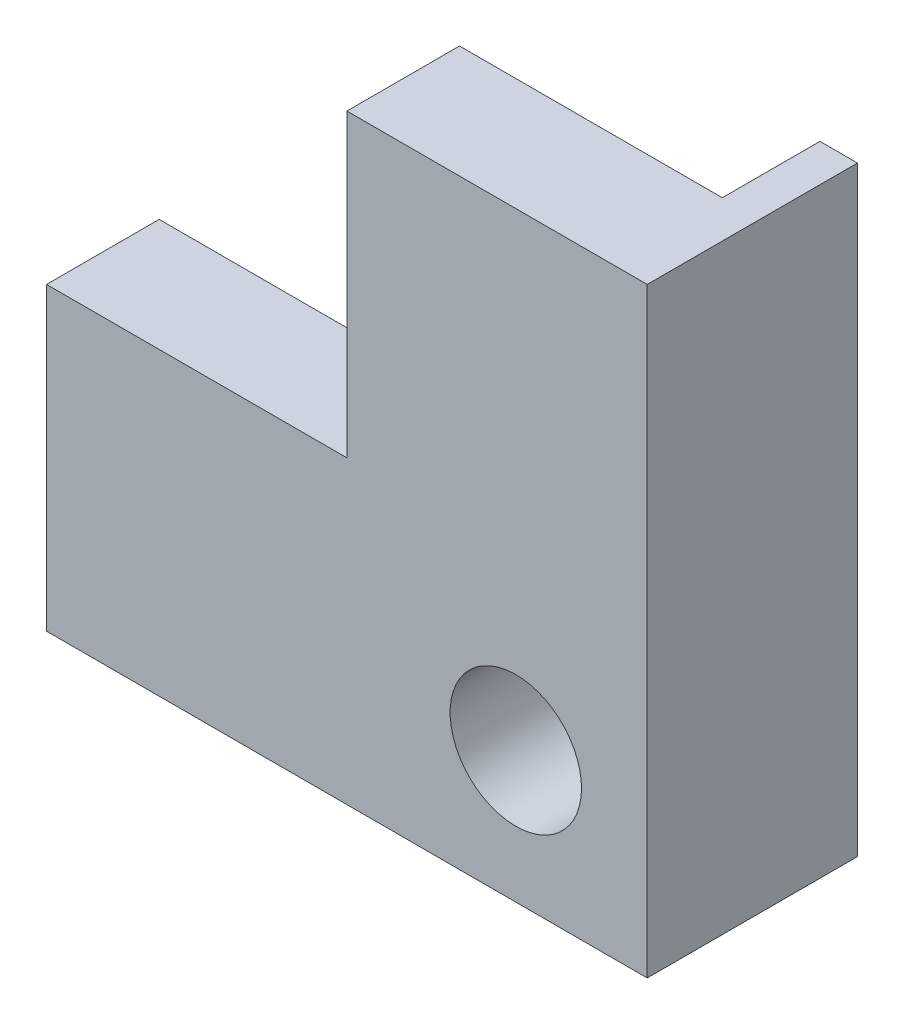
ISO-10303-21;
HEADER;
FILE_DESCRIPTION(('STEP AP214'),'2;1');
FILE_NAME('part.step','',(''),(''),'','','');
FILE_SCHEMA(('AUTOMOTIVE_DESIGN { 1 0 10303 214 1 1 1 1 }'));
ENDSEC;
DATA;
#1=APPLICATION_CONTEXT('core data for automotive mechanical design processes');
#2=APPLICATION_PROTOCOL_DEFINITION('international standard','automotive_design',2000,#1);
#3=PRODUCT_CONTEXT('',#1,'mechanical');
#4=PRODUCT('Part','Part','',(#3));
#5=PRODUCT_RELATED_PRODUCT_CATEGORY('part','',(#4));
#6=PRODUCT_DEFINITION_FORMATION('','',#4);
#7=PRODUCT_DEFINITION_CONTEXT('part definition',#1,'design');
#8=PRODUCT_DEFINITION('design','',#6,#7);
#9=PRODUCT_DEFINITION_SHAPE('','',#8);
#10=(LENGTH_UNIT() NAMED_UNIT(*) SI_UNIT(.MILLI.,.METRE.));
#11=(NAMED_UNIT(*) PLANE_ANGLE_UNIT() SI_UNIT($,.RADIAN.));
#12=(NAMED_UNIT(*) SI_UNIT($,.STERADIAN.) SOLID_ANGLE_UNIT());
#13=UNCERTAINTY_MEASURE_WITH_UNIT(LENGTH_MEASURE(1.E-05),#10,'distance_accuracy_value','');
#14=(GEOMETRIC_REPRESENTATION_CONTEXT(3) GLOBAL_UNCERTAINTY_ASSIGNED_CONTEXT((#13)) GLOBAL_UNIT_ASSIGNED_CONTEXT((#10,
#11,#12)) REPRESENTATION_CONTEXT('',''));
#15=CARTESIAN_POINT('',(0.,0.,0.));
#16=DIRECTION('',(0.,0.,1.));
#17=DIRECTION('',(1.,0.,0.));
#18=AXIS2_PLACEMENT_3D('',#15,#16,#17);
#19=CARTESIAN_POINT('',(0.,0.,3.));
#20=DIRECTION('',(0.,0.,-1.));
#21=DIRECTION('',(-1.,0.,0.));
#22=AXIS2_PLACEMENT_3D('',#19,#20,#21);
#23=PLANE('',#22);
#24=DIRECTION('',(0.,1.,0.));
#25=VECTOR('',#24,1.);
#26=CARTESIAN_POINT('',(105.864902494354,-136.367060458206,3.));
#27=LINE('',#26,#25);
#28=CARTESIAN_POINT('',(105.864902494354,-136.367060458206,3.));
#29=VERTEX_POINT('',#28);
#30=CARTESIAN_POINT('',(105.864902494354,-120.367060458206,3.));
#31=VERTEX_POINT('',#30);
#32=EDGE_CURVE('E161',#29,#31,#27,.T.);
#33=ORIENTED_EDGE('',*,*,#32,.T.);
#34=DIRECTION('',(-1.,0.,0.));
#35=VECTOR('',#34,1.);
#36=CARTESIAN_POINT('',(97.8649024943537,-120.367060458206,3.));
#37=LINE('',#36,#35);
#38=CARTESIAN_POINT('',(97.8649024943537,-120.367060458206,3.));
#39=VERTEX_POINT('',#38);
#40=EDGE_CURVE('E196',#31,#39,#37,.T.);
#41=ORIENTED_EDGE('',*,*,#40,.T.);
#42=DIRECTION('',(0.,-1.,0.));
#43=VECTOR('',#42,1.);
#44=CARTESIAN_POINT('',(97.8649024943537,-128.367060458206,3.));
#45=LINE('',#44,#43);
#46=CARTESIAN_POINT('',(97.8649024943537,-128.367060458206,3.));
#47=VERTEX_POINT('',#46);
#48=EDGE_CURVE('E198',#39,#47,#45,.T.);
#49=ORIENTED_EDGE('',*,*,#48,.T.);
#50=DIRECTION('',(-1.,0.,0.));
#51=VECTOR('',#50,1.);
#52=CARTESIAN_POINT('',(89.8649024943537,-128.367060458206,3.));
#53=LINE('',#52,#51);
#54=CARTESIAN_POINT('',(89.8649024943537,-128.367060458206,3.));
#55=VERTEX_POINT('',#54);
#56=EDGE_CURVE('E201',#47,#55,#53,.T.);
#57=ORIENTED_EDGE('',*,*,#56,.T.);
#58=DIRECTION('',(0.,-1.,0.));
#59=VECTOR('',#58,1.);
#60=CARTESIAN_POINT('',(89.8649024943537,-135.367060458206,3.));
#61=LINE('',#60,#59);
#62=CARTESIAN_POINT('',(89.8649024943537,-136.367060458206,3.));
#63=VERTEX_POINT('',#62);
#64=EDGE_CURVE('E203',#55,#63,#61,.T.);
#65=ORIENTED_EDGE('',*,*,#64,.T.);
#66=DIRECTION('',(1.,0.,0.));
#67=VECTOR('',#66,1.);
#68=CARTESIAN_POINT('',(89.8649024943537,-136.367060458206,3.));
#69=LINE('',#68,#67);
#70=EDGE_CURVE('E158',#63,#29,#69,.T.);
#71=ORIENTED_EDGE('',*,*,#70,.T.);
#72=EDGE_LOOP('',(#33,#41,#49,#57,#65,#71));
#73=FACE_BOUND('',#72,.T.);
#74=CARTESIAN_POINT('',(102.364902494354,-132.867060458206,3.));
#75=DIRECTION('',(0.,0.,1.));
#76=DIRECTION('',(1.,0.,0.));
#77=AXIS2_PLACEMENT_3D('',#74,#75,#76);
#78=CIRCLE('',#77,1.75);
#79=CARTESIAN_POINT('',(104.114902494354,-132.867060458206,3.));
#80=VERTEX_POINT('',#79);
#81=EDGE_CURVE('E190',#80,#80,#78,.T.);
#82=ORIENTED_EDGE('',*,*,#81,.F.);
#83=EDGE_LOOP('',(#82));
#84=FACE_BOUND('',#83,.T.);
#85=ADVANCED_FACE('F33',(#73,#84),#23,.F.);
#86=CARTESIAN_POINT('',(0.,0.,0.));
#87=DIRECTION('',(0.,0.,-1.));
#88=DIRECTION('',(-1.,0.,0.));
#89=AXIS2_PLACEMENT_3D('',#86,#87,#88);
#90=PLANE('',#89);
#91=DIRECTION('',(0.,1.,0.));
#92=VECTOR('',#91,1.);
#93=CARTESIAN_POINT('',(104.864902494354,-120.367060458206,0.));
#94=LINE('',#93,#92);
#95=CARTESIAN_POINT('',(104.864902494354,-135.367060458206,0.));
#96=VERTEX_POINT('',#95);
#97=CARTESIAN_POINT('',(104.864902494354,-120.367060458206,0.));
#98=VERTEX_POINT('',#97);
#99=EDGE_CURVE('E193',#96,#98,#94,.T.);
#100=ORIENTED_EDGE('',*,*,#99,.F.);
#101=DIRECTION('',(1.,0.,0.));
#102=VECTOR('',#101,1.);
#103=CARTESIAN_POINT('',(104.864902494354,-135.367060458206,0.));
#104=LINE('',#103,#102);
#105=CARTESIAN_POINT('',(89.8649024943537,-135.367060458206,0.));
#106=VERTEX_POINT('',#105);
#107=EDGE_CURVE('E199',#106,#96,#104,.T.);
#108=ORIENTED_EDGE('',*,*,#107,.F.);
#109=DIRECTION('',(0.,-1.,0.));
#110=VECTOR('',#109,1.);
#111=CARTESIAN_POINT('',(89.8649024943537,-135.367060458206,0.));
#112=LINE('',#111,#110);
#113=CARTESIAN_POINT('',(89.8649024943537,-128.367060458206,0.));
#114=VERTEX_POINT('',#113);
#115=EDGE_CURVE('E213',#114,#106,#112,.T.);
#116=ORIENTED_EDGE('',*,*,#115,.F.);
#117=DIRECTION('',(-1.,0.,0.));
#118=VECTOR('',#117,1.);
#119=CARTESIAN_POINT('',(89.8649024943537,-128.367060458206,0.));
#120=LINE('',#119,#118);
#121=CARTESIAN_POINT('',(97.8649024943537,-128.367060458206,0.));
#122=VERTEX_POINT('',#121);
#123=EDGE_CURVE('E211',#122,#114,#120,.T.);
#124=ORIENTED_EDGE('',*,*,#123,.F.);
#125=DIRECTION('',(0.,-1.,0.));
#126=VECTOR('',#125,1.);
#127=CARTESIAN_POINT('',(97.8649024943537,-128.367060458206,0.));
#128=LINE('',#127,#126);
#129=CARTESIAN_POINT('',(97.8649024943537,-120.367060458206,0.));
#130=VERTEX_POINT('',#129);
#131=EDGE_CURVE('E209',#130,#122,#128,.T.);
#132=ORIENTED_EDGE('',*,*,#131,.F.);
#133=DIRECTION('',(-1.,0.,0.));
#134=VECTOR('',#133,1.);
#135=CARTESIAN_POINT('',(97.8649024943537,-120.367060458206,0.));
#136=LINE('',#135,#134);
#137=EDGE_CURVE('E207',#98,#130,#136,.T.);
#138=ORIENTED_EDGE('',*,*,#137,.F.);
#139=EDGE_LOOP('',(#100,#108,#116,#124,#132,#138));
#140=FACE_BOUND('',#139,.T.);
#141=CARTESIAN_POINT('',(102.364902494354,-132.867060458206,0.));
#142=DIRECTION('',(0.,0.,1.));
#143=DIRECTION('',(1.,0.,0.));
#144=AXIS2_PLACEMENT_3D('',#141,#142,#143);
#145=CIRCLE('',#144,1.75);
#146=CARTESIAN_POINT('',(104.114902494354,-132.867060458206,0.));
#147=VERTEX_POINT('',#146);
#148=EDGE_CURVE('E177',#147,#147,#145,.T.);
#149=ORIENTED_EDGE('',*,*,#148,.T.);
#150=EDGE_LOOP('',(#149));
#151=FACE_BOUND('',#150,.T.);
#152=ADVANCED_FACE('F231',(#140,#151),#90,.T.);
#153=CARTESIAN_POINT('',(97.8649024943537,-120.367060458206,3.));
#154=DIRECTION('',(0.,-1.,0.));
#155=DIRECTION('',(0.,0.,-1.));
#156=AXIS2_PLACEMENT_3D('',#153,#154,#155);
#157=PLANE('',#156);
#158=ORIENTED_EDGE('',*,*,#137,.T.);
#159=DIRECTION('',(0.,0.,-1.));
#160=VECTOR('',#159,1.);
#161=CARTESIAN_POINT('',(97.8649024943537,-120.367060458206,3.));
#162=LINE('',#161,#160);
#163=EDGE_CURVE('E11',#39,#130,#162,.T.);
#164=ORIENTED_EDGE('',*,*,#163,.F.);
#165=ORIENTED_EDGE('',*,*,#40,.F.);
#166=DIRECTION('',(0.,0.,1.));
#167=VECTOR('',#166,1.);
#168=CARTESIAN_POINT('',(105.864902494354,-120.367060458206,-2.6));
#169=LINE('',#168,#167);
#170=CARTESIAN_POINT('',(105.864902494354,-120.367060458206,-2.6));
#171=VERTEX_POINT('',#170);
#172=EDGE_CURVE('E179',#171,#31,#169,.T.);
#173=ORIENTED_EDGE('',*,*,#172,.F.);
#174=DIRECTION('',(-1.,0.,0.));
#175=VECTOR('',#174,1.);
#176=CARTESIAN_POINT('',(105.864902494354,-120.367060458206,-2.6));
#177=LINE('',#176,#175);
#178=CARTESIAN_POINT('',(104.864902494354,-120.367060458206,-2.6));
#179=VERTEX_POINT('',#178);
#180=EDGE_CURVE('E132',#171,#179,#177,.T.);
#181=ORIENTED_EDGE('',*,*,#180,.T.);
#182=DIRECTION('',(0.,0.,1.));
#183=VECTOR('',#182,1.);
#184=CARTESIAN_POINT('',(104.864902494354,-120.367060458206,-2.6));
#185=LINE('',#184,#183);
#186=CARTESIAN_POINT('',(104.864902494354,-120.367060458206,-1.6));
#187=VERTEX_POINT('',#186);
#188=EDGE_CURVE('E143',#179,#187,#185,.T.);
#189=ORIENTED_EDGE('',*,*,#188,.T.);
#190=EDGE_CURVE('E53',#187,#98,#185,.T.);
#191=ORIENTED_EDGE('',*,*,#190,.T.);
#192=EDGE_LOOP('',(#158,#164,#165,#173,#181,#189,#191));
#193=FACE_BOUND('',#192,.T.);
#194=ADVANCED_FACE('F35',(#193),#157,.F.);
#195=CARTESIAN_POINT('',(97.8649024943537,-128.367060458206,3.));
#196=DIRECTION('',(1.,0.,0.));
#197=DIRECTION('',(0.,1.,0.));
#198=AXIS2_PLACEMENT_3D('',#195,#196,#197);
#199=PLANE('',#198);
#200=ORIENTED_EDGE('',*,*,#131,.T.);
#201=DIRECTION('',(0.,0.,-1.));
#202=VECTOR('',#201,1.);
#203=CARTESIAN_POINT('',(97.8649024943537,-128.367060458206,3.));
#204=LINE('',#203,#202);
#205=EDGE_CURVE('E41',#47,#122,#204,.T.);
#206=ORIENTED_EDGE('',*,*,#205,.F.);
#207=ORIENTED_EDGE('',*,*,#48,.F.);
#208=ORIENTED_EDGE('',*,*,#163,.T.);
#209=EDGE_LOOP('',(#200,#206,#207,#208));
#210=FACE_BOUND('',#209,.T.);
#211=ADVANCED_FACE('F244',(#210),#199,.F.);
#212=CARTESIAN_POINT('',(89.8649024943537,-128.367060458206,3.));
#213=DIRECTION('',(0.,-1.,0.));
#214=DIRECTION('',(0.,0.,-1.));
#215=AXIS2_PLACEMENT_3D('',#212,#213,#214);
#216=PLANE('',#215);
#217=ORIENTED_EDGE('',*,*,#123,.T.);
#218=DIRECTION('',(0.,0.,-1.));
#219=VECTOR('',#218,1.);
#220=CARTESIAN_POINT('',(89.8649024943537,-128.367060458206,3.));
#221=LINE('',#220,#219);
#222=EDGE_CURVE('E205',#55,#114,#221,.T.);
#223=ORIENTED_EDGE('',*,*,#222,.F.);
#224=ORIENTED_EDGE('',*,*,#56,.F.);
#225=ORIENTED_EDGE('',*,*,#205,.T.);
#226=EDGE_LOOP('',(#217,#223,#224,#225));
#227=FACE_BOUND('',#226,.T.);
#228=ADVANCED_FACE('F223',(#227),#216,.F.);
#229=CARTESIAN_POINT('',(89.8649024943537,-135.367060458206,3.));
#230=DIRECTION('',(1.,0.,0.));
#231=DIRECTION('',(0.,0.,-1.));
#232=AXIS2_PLACEMENT_3D('',#229,#230,#231);
#233=PLANE('',#232);
#234=ORIENTED_EDGE('',*,*,#115,.T.);
#235=DIRECTION('',(0.,0.,1.));
#236=VECTOR('',#235,1.);
#237=CARTESIAN_POINT('',(89.8649024943537,-135.367060458206,-2.6));
#238=LINE('',#237,#236);
#239=CARTESIAN_POINT('',(89.8649024943537,-135.367060458206,-1.6));
#240=VERTEX_POINT('',#239);
#241=EDGE_CURVE('E131',#240,#106,#238,.T.);
#242=ORIENTED_EDGE('',*,*,#241,.F.);
#243=CARTESIAN_POINT('',(89.8649024943537,-135.367060458206,-2.6));
#244=VERTEX_POINT('',#243);
#245=EDGE_CURVE('E187',#244,#240,#238,.T.);
#246=ORIENTED_EDGE('',*,*,#245,.F.);
#247=DIRECTION('',(0.,-1.,0.));
#248=VECTOR('',#247,1.);
#249=CARTESIAN_POINT('',(89.8649024943537,-135.367060458206,-2.6));
#250=LINE('',#249,#248);
#251=CARTESIAN_POINT('',(89.8649024943537,-136.367060458206,-2.6));
#252=VERTEX_POINT('',#251);
#253=EDGE_CURVE('E160',#244,#252,#250,.T.);
#254=ORIENTED_EDGE('',*,*,#253,.T.);
#255=DIRECTION('',(0.,0.,1.));
#256=VECTOR('',#255,1.);
#257=CARTESIAN_POINT('',(89.8649024943537,-136.367060458206,-2.6));
#258=LINE('',#257,#256);
#259=EDGE_CURVE('E184',#252,#63,#258,.T.);
#260=ORIENTED_EDGE('',*,*,#259,.T.);
#261=ORIENTED_EDGE('',*,*,#64,.F.);
#262=ORIENTED_EDGE('',*,*,#222,.T.);
#263=EDGE_LOOP('',(#234,#242,#246,#254,#260,#261,#262));
#264=FACE_BOUND('',#263,.T.);
#265=ADVANCED_FACE('F237',(#264),#233,.F.);
#266=CARTESIAN_POINT('',(102.364902494354,-132.867060458206,3.));
#267=DIRECTION('',(0.,0.,-1.));
#268=DIRECTION('',(-1.,0.,0.));
#269=AXIS2_PLACEMENT_3D('',#266,#267,#268);
#270=CYLINDRICAL_SURFACE('',#269,1.75);
#271=ORIENTED_EDGE('',*,*,#81,.T.);
#272=EDGE_LOOP('',(#271));
#273=FACE_BOUND('',#272,.T.);
#274=ORIENTED_EDGE('',*,*,#148,.F.);
#275=EDGE_LOOP('',(#274));
#276=FACE_BOUND('',#275,.T.);
#277=ADVANCED_FACE('F277',(#273,#276),#270,.F.);
#278=CARTESIAN_POINT('',(104.864902494354,-135.367060458206,-2.6));
#279=DIRECTION('',(0.,1.,0.));
#280=DIRECTION('',(0.,0.,1.));
#281=AXIS2_PLACEMENT_3D('',#278,#279,#280);
#282=PLANE('',#281);
#283=DIRECTION('',(0.,0.,-1.));
#284=VECTOR('',#283,1.);
#285=CARTESIAN_POINT('',(97.3649024943537,-135.367060458206,-1.6));
#286=LINE('',#285,#284);
#287=CARTESIAN_POINT('',(97.3649024943537,-135.367060458206,-1.6));
#288=VERTEX_POINT('',#287);
#289=CARTESIAN_POINT('',(97.3649024943537,-135.367060458206,-2.6));
#290=VERTEX_POINT('',#289);
#291=EDGE_CURVE('E154',#288,#290,#286,.T.);
#292=ORIENTED_EDGE('',*,*,#291,.F.);
#293=DIRECTION('',(-1.,0.,0.));
#294=VECTOR('',#293,1.);
#295=CARTESIAN_POINT('',(89.8649024943537,-135.367060458206,-1.6));
#296=LINE('',#295,#294);
#297=EDGE_CURVE('E152',#288,#240,#296,.T.);
#298=ORIENTED_EDGE('',*,*,#297,.T.);
#299=ORIENTED_EDGE('',*,*,#241,.T.);
#300=ORIENTED_EDGE('',*,*,#107,.T.);
#301=DIRECTION('',(0.,0.,1.));
#302=VECTOR('',#301,1.);
#303=CARTESIAN_POINT('',(104.864902494354,-135.367060458206,-2.6));
#304=LINE('',#303,#302);
#305=CARTESIAN_POINT('',(104.864902494354,-135.367060458206,-2.6));
#306=VERTEX_POINT('',#305);
#307=EDGE_CURVE('E175',#306,#96,#304,.T.);
#308=ORIENTED_EDGE('',*,*,#307,.F.);
#309=DIRECTION('',(-1.,0.,0.));
#310=VECTOR('',#309,1.);
#311=CARTESIAN_POINT('',(104.864902494354,-135.367060458206,-2.6));
#312=LINE('',#311,#310);
#313=EDGE_CURVE('E128',#306,#290,#312,.T.);
#314=ORIENTED_EDGE('',*,*,#313,.T.);
#315=EDGE_LOOP('',(#292,#298,#299,#300,#308,#314));
#316=FACE_BOUND('',#315,.T.);
#317=ADVANCED_FACE('F247',(#316),#282,.T.);
#318=CARTESIAN_POINT('',(104.864902494354,-120.367060458206,-2.6));
#319=DIRECTION('',(-1.,0.,0.));
#320=DIRECTION('',(0.,-1.,0.));
#321=AXIS2_PLACEMENT_3D('',#318,#319,#320);
#322=PLANE('',#321);
#323=DIRECTION('',(0.,0.,-1.));
#324=VECTOR('',#323,1.);
#325=CARTESIAN_POINT('',(104.864902494354,-127.867060458206,-1.6));
#326=LINE('',#325,#324);
#327=CARTESIAN_POINT('',(104.864902494354,-127.867060458206,-1.6));
#328=VERTEX_POINT('',#327);
#329=CARTESIAN_POINT('',(104.864902494354,-127.867060458206,-2.6));
#330=VERTEX_POINT('',#329);
#331=EDGE_CURVE('E134',#328,#330,#326,.T.);
#332=ORIENTED_EDGE('',*,*,#331,.T.);
#333=DIRECTION('',(0.,-1.,0.));
#334=VECTOR('',#333,1.);
#335=CARTESIAN_POINT('',(104.864902494354,-120.367060458206,-2.6));
#336=LINE('',#335,#334);
#337=EDGE_CURVE('E122',#330,#306,#336,.T.);
#338=ORIENTED_EDGE('',*,*,#337,.T.);
#339=ORIENTED_EDGE('',*,*,#307,.T.);
#340=ORIENTED_EDGE('',*,*,#99,.T.);
#341=ORIENTED_EDGE('',*,*,#190,.F.);
#342=DIRECTION('',(0.,-1.,0.));
#343=VECTOR('',#342,1.);
#344=CARTESIAN_POINT('',(104.864902494354,-127.867060458206,-1.6));
#345=LINE('',#344,#343);
#346=EDGE_CURVE('E48',#187,#328,#345,.T.);
#347=ORIENTED_EDGE('',*,*,#346,.T.);
#348=EDGE_LOOP('',(#332,#338,#339,#340,#341,#347));
#349=FACE_BOUND('',#348,.T.);
#350=ADVANCED_FACE('F135',(#349),#322,.T.);
#351=CARTESIAN_POINT('',(105.864902494354,-136.367060458206,-2.6));
#352=DIRECTION('',(1.,0.,0.));
#353=DIRECTION('',(0.,0.,-1.));
#354=AXIS2_PLACEMENT_3D('',#351,#352,#353);
#355=PLANE('',#354);
#356=ORIENTED_EDGE('',*,*,#32,.F.);
#357=DIRECTION('',(0.,0.,1.));
#358=VECTOR('',#357,1.);
#359=CARTESIAN_POINT('',(105.864902494354,-136.367060458206,-2.6));
#360=LINE('',#359,#358);
#361=CARTESIAN_POINT('',(105.864902494354,-136.367060458206,-2.6));
#362=VERTEX_POINT('',#361);
#363=EDGE_CURVE('E182',#362,#29,#360,.T.);
#364=ORIENTED_EDGE('',*,*,#363,.F.);
#365=DIRECTION('',(0.,1.,0.));
#366=VECTOR('',#365,1.);
#367=CARTESIAN_POINT('',(105.864902494354,-136.367060458206,-2.6));
#368=LINE('',#367,#366);
#369=EDGE_CURVE('E167',#362,#171,#368,.T.);
#370=ORIENTED_EDGE('',*,*,#369,.T.);
#371=ORIENTED_EDGE('',*,*,#172,.T.);
#372=EDGE_LOOP('',(#356,#364,#370,#371));
#373=FACE_BOUND('',#372,.T.);
#374=ADVANCED_FACE('F261',(#373),#355,.T.);
#375=CARTESIAN_POINT('',(89.8649024943537,-136.367060458206,-2.6));
#376=DIRECTION('',(0.,-1.,0.));
#377=DIRECTION('',(0.,0.,-1.));
#378=AXIS2_PLACEMENT_3D('',#375,#376,#377);
#379=PLANE('',#378);
#380=ORIENTED_EDGE('',*,*,#70,.F.);
#381=ORIENTED_EDGE('',*,*,#259,.F.);
#382=DIRECTION('',(1.,0.,0.));
#383=VECTOR('',#382,1.);
#384=CARTESIAN_POINT('',(89.8649024943537,-136.367060458206,-2.6));
#385=LINE('',#384,#383);
#386=EDGE_CURVE('E164',#252,#362,#385,.T.);
#387=ORIENTED_EDGE('',*,*,#386,.T.);
#388=ORIENTED_EDGE('',*,*,#363,.T.);
#389=EDGE_LOOP('',(#380,#381,#387,#388));
#390=FACE_BOUND('',#389,.T.);
#391=ADVANCED_FACE('F258',(#390),#379,.T.);
#392=CARTESIAN_POINT('',(0.,0.,-2.6));
#393=DIRECTION('',(0.,0.,1.));
#394=DIRECTION('',(1.,0.,0.));
#395=AXIS2_PLACEMENT_3D('',#392,#393,#394);
#396=PLANE('',#395);
#397=ORIENTED_EDGE('',*,*,#313,.F.);
#398=ORIENTED_EDGE('',*,*,#337,.F.);
#399=CARTESIAN_POINT('',(110.291433991525,-124.117060458206,-2.6));
#400=DIRECTION('',(0.,0.,-1.));
#401=DIRECTION('',(1.,0.,0.));
#402=AXIS2_PLACEMENT_3D('',#399,#400,#401);
#403=CIRCLE('',#402,6.59619163531477);
#404=EDGE_CURVE('E126',#330,#179,#403,.T.);
#405=ORIENTED_EDGE('',*,*,#404,.T.);
#406=ORIENTED_EDGE('',*,*,#180,.F.);
#407=ORIENTED_EDGE('',*,*,#369,.F.);
#408=ORIENTED_EDGE('',*,*,#386,.F.);
#409=ORIENTED_EDGE('',*,*,#253,.F.);
#410=CARTESIAN_POINT('',(93.6149024943537,-140.793591955378,-2.6));
#411=DIRECTION('',(0.,0.,-1.));
#412=DIRECTION('',(-1.,0.,0.));
#413=AXIS2_PLACEMENT_3D('',#410,#411,#412);
#414=CIRCLE('',#413,6.59619163531478);
#415=EDGE_CURVE('E139',#244,#290,#414,.T.);
#416=ORIENTED_EDGE('',*,*,#415,.T.);
#417=EDGE_LOOP('',(#397,#398,#405,#406,#407,#408,#409,#416));
#418=FACE_BOUND('',#417,.T.);
#419=ADVANCED_FACE('F123',(#418),#396,.F.);
#420=CARTESIAN_POINT('',(93.6149024943537,-140.793591955378,-1.6));
#421=DIRECTION('',(0.,0.,-1.));
#422=DIRECTION('',(-1.,0.,0.));
#423=AXIS2_PLACEMENT_3D('',#420,#421,#422);
#424=CYLINDRICAL_SURFACE('',#423,6.59619163531478);
#425=ORIENTED_EDGE('',*,*,#415,.F.);
#426=ORIENTED_EDGE('',*,*,#245,.T.);
#427=CARTESIAN_POINT('',(93.6149024943537,-140.793591955378,-1.6));
#428=DIRECTION('',(0.,0.,-1.));
#429=DIRECTION('',(-1.,0.,0.));
#430=AXIS2_PLACEMENT_3D('',#427,#428,#429);
#431=CIRCLE('',#430,6.59619163531478);
#432=EDGE_CURVE('E149',#240,#288,#431,.T.);
#433=ORIENTED_EDGE('',*,*,#432,.T.);
#434=ORIENTED_EDGE('',*,*,#291,.T.);
#435=EDGE_LOOP('',(#425,#426,#433,#434));
#436=FACE_BOUND('',#435,.T.);
#437=ADVANCED_FACE('F254',(#436),#424,.T.);
#438=CARTESIAN_POINT('',(93.6149024943537,-140.793591955378,-1.6));
#439=DIRECTION('',(0.,0.,-1.));
#440=DIRECTION('',(-1.,0.,0.));
#441=AXIS2_PLACEMENT_3D('',#438,#439,#440);
#442=PLANE('',#441);
#443=ORIENTED_EDGE('',*,*,#432,.F.);
#444=ORIENTED_EDGE('',*,*,#297,.F.);
#445=EDGE_LOOP('',(#443,#444));
#446=FACE_BOUND('',#445,.T.);
#447=ADVANCED_FACE('F251',(#446),#442,.F.);
#448=CARTESIAN_POINT('',(110.291433991525,-124.117060458206,-1.6));
#449=DIRECTION('',(0.,0.,-1.));
#450=DIRECTION('',(-1.,0.,0.));
#451=AXIS2_PLACEMENT_3D('',#448,#449,#450);
#452=CYLINDRICAL_SURFACE('',#451,6.59619163531477);
#453=ORIENTED_EDGE('',*,*,#404,.F.);
#454=ORIENTED_EDGE('',*,*,#331,.F.);
#455=CARTESIAN_POINT('',(110.291433991525,-124.117060458206,-1.6));
#456=DIRECTION('',(0.,0.,-1.));
#457=DIRECTION('',(1.,0.,0.));
#458=AXIS2_PLACEMENT_3D('',#455,#456,#457);
#459=CIRCLE('',#458,6.59619163531477);
#460=EDGE_CURVE('E144',#328,#187,#459,.T.);
#461=ORIENTED_EDGE('',*,*,#460,.T.);
#462=ORIENTED_EDGE('',*,*,#188,.F.);
#463=EDGE_LOOP('',(#453,#454,#461,#462));
#464=FACE_BOUND('',#463,.T.);
#465=ADVANCED_FACE('F142',(#464),#452,.T.);
#466=CARTESIAN_POINT('',(110.291433991525,-124.117060458206,-1.6));
#467=DIRECTION('',(0.,0.,1.));
#468=DIRECTION('',(1.,0.,0.));
#469=AXIS2_PLACEMENT_3D('',#466,#467,#468);
#470=PLANE('',#469);
#471=ORIENTED_EDGE('',*,*,#460,.F.);
#472=ORIENTED_EDGE('',*,*,#346,.F.);
#473=EDGE_LOOP('',(#471,#472));
#474=FACE_BOUND('',#473,.T.);
#475=ADVANCED_FACE('F263',(#474),#470,.T.);
#476=CLOSED_SHELL('',(#85,#152,#194,#211,#228,#265,#277,#317,#350,#374,#391,#419,#437,#447,#465,#475));
#477=MANIFOLD_SOLID_BREP('B2',#476);
#478=ADVANCED_BREP_SHAPE_REPRESENTATION('',(#18,#477),#14);
#479=SHAPE_DEFINITION_REPRESENTATION(#9,#478);
ENDSEC;
END-ISO-10303-21;
